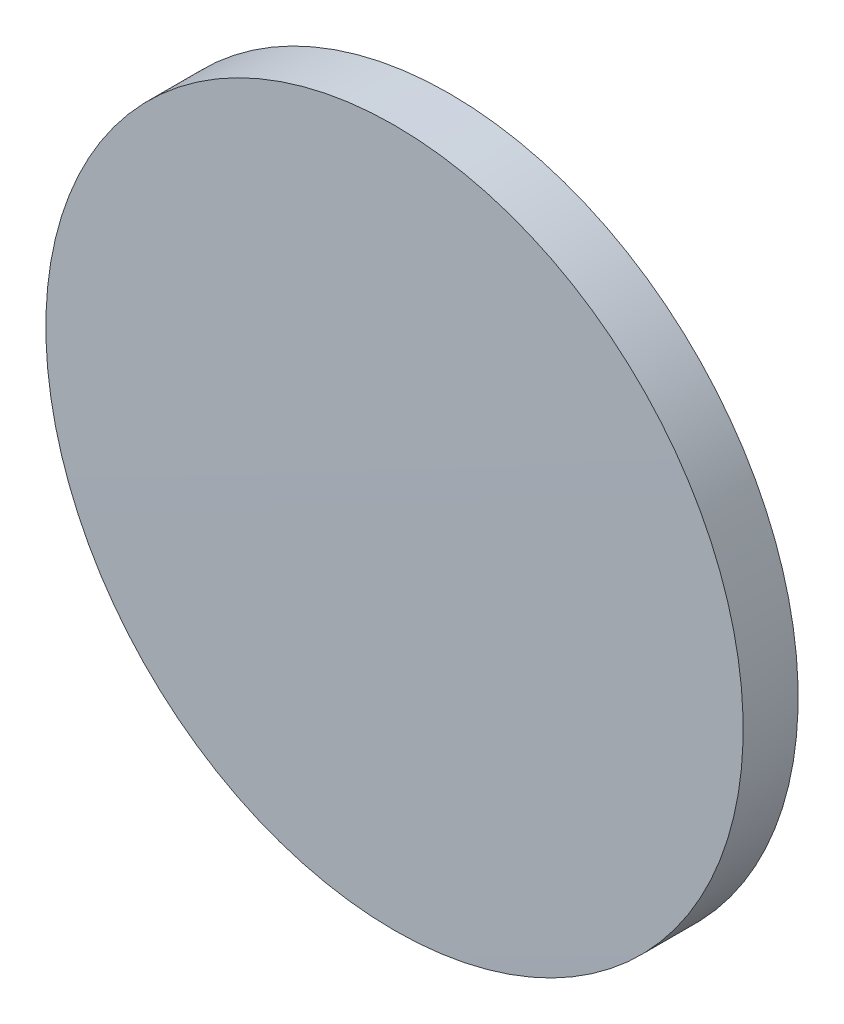
ISO-10303-21;
HEADER;
FILE_DESCRIPTION(('STEP AP214'),'2;1');
FILE_NAME('part.step','',(''),(''),'','','');
FILE_SCHEMA(('AUTOMOTIVE_DESIGN { 1 0 10303 214 1 1 1 1 }'));
ENDSEC;
DATA;
#1=APPLICATION_CONTEXT('core data for automotive mechanical design processes');
#2=APPLICATION_PROTOCOL_DEFINITION('international standard','automotive_design',2000,#1);
#3=PRODUCT_CONTEXT('',#1,'mechanical');
#4=PRODUCT('Part','Part','',(#3));
#5=PRODUCT_RELATED_PRODUCT_CATEGORY('part','',(#4));
#6=PRODUCT_DEFINITION_FORMATION('','',#4);
#7=PRODUCT_DEFINITION_CONTEXT('part definition',#1,'design');
#8=PRODUCT_DEFINITION('design','',#6,#7);
#9=PRODUCT_DEFINITION_SHAPE('','',#8);
#10=(LENGTH_UNIT() NAMED_UNIT(*) SI_UNIT(.MILLI.,.METRE.));
#11=(NAMED_UNIT(*) PLANE_ANGLE_UNIT() SI_UNIT($,.RADIAN.));
#12=(NAMED_UNIT(*) SI_UNIT($,.STERADIAN.) SOLID_ANGLE_UNIT());
#13=UNCERTAINTY_MEASURE_WITH_UNIT(LENGTH_MEASURE(1.E-05),#10,'distance_accuracy_value','');
#14=(GEOMETRIC_REPRESENTATION_CONTEXT(3) GLOBAL_UNCERTAINTY_ASSIGNED_CONTEXT((#13)) GLOBAL_UNIT_ASSIGNED_CONTEXT((#10,
#11,#12)) REPRESENTATION_CONTEXT('',''));
#15=CARTESIAN_POINT('',(0.,0.,0.));
#16=DIRECTION('',(0.,0.,1.));
#17=DIRECTION('',(1.,0.,0.));
#18=AXIS2_PLACEMENT_3D('',#15,#16,#17);
#19=CARTESIAN_POINT('',(0.,0.,-1.03));
#20=DIRECTION('',(0.,0.,-1.));
#21=DIRECTION('',(0.,1.,0.));
#22=AXIS2_PLACEMENT_3D('',#19,#20,#21);
#23=PLANE('',#22);
#24=CARTESIAN_POINT('',(0.,0.,-1.03));
#25=DIRECTION('',(0.,0.,-1.));
#26=DIRECTION('',(0.,1.,0.));
#27=AXIS2_PLACEMENT_3D('',#24,#25,#26);
#28=CIRCLE('',#27,12.7);
#29=CARTESIAN_POINT('',(0.,12.7,-1.03));
#30=VERTEX_POINT('',#29);
#31=EDGE_CURVE('E36',#30,#30,#28,.T.);
#32=ORIENTED_EDGE('',*,*,#31,.T.);
#33=EDGE_LOOP('',(#32));
#34=FACE_BOUND('',#33,.T.);
#35=ADVANCED_FACE('F30',(#34),#23,.T.);
#36=CARTESIAN_POINT('',(0.,1.71519835443987E-13,-1401.632));
#37=DIRECTION('',(0.,0.,-1.));
#38=DIRECTION('',(0.,1.,0.));
#39=AXIS2_PLACEMENT_3D('',#36,#37,#38);
#40=SPHERICAL_SURFACE('',#39,1402.662);
#41=CARTESIAN_POINT('',(0.,0.,0.972504571406403));
#42=DIRECTION('',(0.,0.,-1.));
#43=DIRECTION('',(0.,1.,0.));
#44=AXIS2_PLACEMENT_3D('',#41,#42,#43);
#45=CIRCLE('',#44,12.7);
#46=CARTESIAN_POINT('',(0.,12.7,0.972504571406407));
#47=VERTEX_POINT('',#46);
#48=EDGE_CURVE('E10',#47,#47,#45,.T.);
#49=ORIENTED_EDGE('',*,*,#48,.F.);
#50=EDGE_LOOP('',(#49));
#51=FACE_BOUND('',#50,.T.);
#52=ADVANCED_FACE('F45',(#51),#40,.T.);
#53=CARTESIAN_POINT('',(0.,0.,-1.03));
#54=DIRECTION('',(0.,0.,-1.));
#55=DIRECTION('',(0.,1.,0.));
#56=AXIS2_PLACEMENT_3D('',#53,#54,#55);
#57=CYLINDRICAL_SURFACE('',#56,12.7);
#58=ORIENTED_EDGE('',*,*,#48,.T.);
#59=EDGE_LOOP('',(#58));
#60=FACE_BOUND('',#59,.T.);
#61=ORIENTED_EDGE('',*,*,#31,.F.);
#62=EDGE_LOOP('',(#61));
#63=FACE_BOUND('',#62,.T.);
#64=ADVANCED_FACE('F43',(#60,#63),#57,.T.);
#65=CLOSED_SHELL('',(#35,#52,#64));
#66=MANIFOLD_SOLID_BREP('B2',#65);
#67=ADVANCED_BREP_SHAPE_REPRESENTATION('',(#18,#66),#14);
#68=SHAPE_DEFINITION_REPRESENTATION(#9,#67);
ENDSEC;
END-ISO-10303-21;
